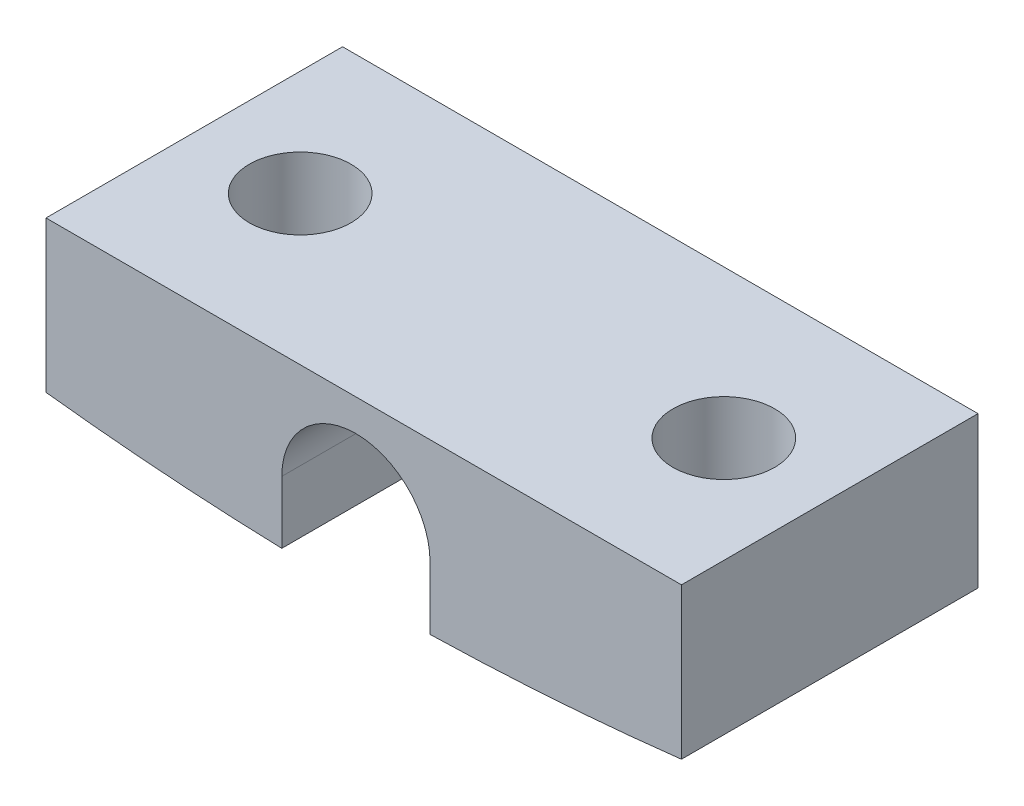
ISO-10303-21;
HEADER;
FILE_DESCRIPTION(('STEP AP214'),'2;1');
FILE_NAME('part.step','',(''),(''),'','','');
FILE_SCHEMA(('AUTOMOTIVE_DESIGN { 1 0 10303 214 1 1 1 1 }'));
ENDSEC;
DATA;
#1=APPLICATION_CONTEXT('core data for automotive mechanical design processes');
#2=APPLICATION_PROTOCOL_DEFINITION('international standard','automotive_design',2000,#1);
#3=PRODUCT_CONTEXT('',#1,'mechanical');
#4=PRODUCT('Part','Part','',(#3));
#5=PRODUCT_RELATED_PRODUCT_CATEGORY('part','',(#4));
#6=PRODUCT_DEFINITION_FORMATION('','',#4);
#7=PRODUCT_DEFINITION_CONTEXT('part definition',#1,'design');
#8=PRODUCT_DEFINITION('design','',#6,#7);
#9=PRODUCT_DEFINITION_SHAPE('','',#8);
#10=(LENGTH_UNIT() NAMED_UNIT(*) SI_UNIT(.MILLI.,.METRE.));
#11=(NAMED_UNIT(*) PLANE_ANGLE_UNIT() SI_UNIT($,.RADIAN.));
#12=(NAMED_UNIT(*) SI_UNIT($,.STERADIAN.) SOLID_ANGLE_UNIT());
#13=UNCERTAINTY_MEASURE_WITH_UNIT(LENGTH_MEASURE(1.E-05),#10,'distance_accuracy_value','');
#14=(GEOMETRIC_REPRESENTATION_CONTEXT(3) GLOBAL_UNCERTAINTY_ASSIGNED_CONTEXT((#13)) GLOBAL_UNIT_ASSIGNED_CONTEXT((#10,
#11,#12)) REPRESENTATION_CONTEXT('',''));
#15=CARTESIAN_POINT('',(0.,0.,0.));
#16=DIRECTION('',(0.,0.,1.));
#17=DIRECTION('',(1.,0.,0.));
#18=AXIS2_PLACEMENT_3D('',#15,#16,#17);
#19=CARTESIAN_POINT('',(0.,0.,7.));
#20=DIRECTION('',(1.,0.,0.));
#21=DIRECTION('',(0.,0.,-1.));
#22=AXIS2_PLACEMENT_3D('',#19,#20,#21);
#23=PLANE('',#22);
#24=DIRECTION('',(0.,-1.,0.));
#25=VECTOR('',#24,1.);
#26=CARTESIAN_POINT('',(0.,0.,0.));
#27=LINE('',#26,#25);
#28=CARTESIAN_POINT('',(0.,0.,0.));
#29=VERTEX_POINT('',#28);
#30=CARTESIAN_POINT('',(0.,-3.56585785072482,0.));
#31=VERTEX_POINT('',#30);
#32=EDGE_CURVE('E140',#29,#31,#27,.T.);
#33=ORIENTED_EDGE('',*,*,#32,.T.);
#34=DIRECTION('',(0.,0.,-1.));
#35=VECTOR('',#34,1.);
#36=CARTESIAN_POINT('',(0.,-3.56585785072482,7.));
#37=LINE('',#36,#35);
#38=CARTESIAN_POINT('',(0.,-3.56585785072482,7.));
#39=VERTEX_POINT('',#38);
#40=EDGE_CURVE('E11',#39,#31,#37,.T.);
#41=ORIENTED_EDGE('',*,*,#40,.F.);
#42=DIRECTION('',(0.,-1.,0.));
#43=VECTOR('',#42,1.);
#44=CARTESIAN_POINT('',(0.,0.,7.));
#45=LINE('',#44,#43);
#46=CARTESIAN_POINT('',(0.,0.,7.));
#47=VERTEX_POINT('',#46);
#48=EDGE_CURVE('E163',#47,#39,#45,.T.);
#49=ORIENTED_EDGE('',*,*,#48,.F.);
#50=DIRECTION('',(0.,0.,-1.));
#51=VECTOR('',#50,1.);
#52=CARTESIAN_POINT('',(0.,0.,7.));
#53=LINE('',#52,#51);
#54=EDGE_CURVE('E136',#47,#29,#53,.T.);
#55=ORIENTED_EDGE('',*,*,#54,.T.);
#56=EDGE_LOOP('',(#33,#41,#49,#55));
#57=FACE_BOUND('',#56,.T.);
#58=ADVANCED_FACE('F39',(#57),#23,.F.);
#59=CARTESIAN_POINT('',(7.5,61.,7.));
#60=DIRECTION('',(0.,0.,-1.));
#61=DIRECTION('',(-1.,0.,0.));
#62=AXIS2_PLACEMENT_3D('',#59,#60,#61);
#63=CYLINDRICAL_SURFACE('',#62,65.);
#64=CARTESIAN_POINT('',(2.5,-3.80740698407863,4.7));
#65=CARTESIAN_POINT('',(2.56748697636121,-3.81261356681244,4.6999970427773));
#66=CARTESIAN_POINT('',(2.63503052118988,-3.81771763752998,4.69428811494105));
#67=CARTESIAN_POINT('',(2.76827643873237,-3.82758109221733,4.67158244655303));
#68=CARTESIAN_POINT('',(2.83397653683242,-3.83234006092647,4.65457234934861));
#69=CARTESIAN_POINT('',(2.9615878821308,-3.8413980884566,4.60973267814247));
#70=CARTESIAN_POINT('',(3.02350055597054,-3.84569732091256,4.58190720746752));
#71=CARTESIAN_POINT('',(3.1417695586381,-3.8537535177467,4.51622185433156));
#72=CARTESIAN_POINT('',(3.19812727952696,-3.85751061809225,4.47836449465973));
#73=CARTESIAN_POINT('',(3.30360157895749,-3.86442040205466,4.39374940368321));
#74=CARTESIAN_POINT('',(3.35272977582148,-3.86757405795157,4.34700623581467));
#75=CARTESIAN_POINT('',(3.4424436189067,-3.87324766128861,4.24590069268484));
#76=CARTESIAN_POINT('',(3.48302902745785,-3.87576759109814,4.19153810551271));
#77=CARTESIAN_POINT('',(3.55440682594677,-3.88014777384982,4.07686844025071));
#78=CARTESIAN_POINT('',(3.58522067086728,-3.88200947308768,4.01657477183992));
#79=CARTESIAN_POINT('',(3.63629182508447,-3.88507083680707,3.89165550200719));
#80=CARTESIAN_POINT('',(3.65654924633519,-3.88627050830961,3.82702994653443));
#81=CARTESIAN_POINT('',(3.68590409538918,-3.88800267081557,3.69538019009488));
#82=CARTESIAN_POINT('',(3.69501734001273,-3.88853610742265,3.62835952795235));
#83=CARTESIAN_POINT('',(3.70187488953552,-3.88893787106932,3.49373731857466));
#84=CARTESIAN_POINT('',(3.69961926395501,-3.88880620217601,3.42613577489409));
#85=CARTESIAN_POINT('',(3.68380843977458,-3.88787824636898,3.29231070889273));
#86=CARTESIAN_POINT('',(3.67025959346128,-3.88708233308359,3.22608643333561));
#87=CARTESIAN_POINT('',(3.63225913366047,-3.88482827187019,3.09685558446968));
#88=CARTESIAN_POINT('',(3.60780751632842,-3.88337012370866,3.03384901229552));
#89=CARTESIAN_POINT('',(3.54869456545837,-3.87979699394782,2.91282351178039));
#90=CARTESIAN_POINT('',(3.51403066941009,-3.87768184748434,2.8548058400025));
#91=CARTESIAN_POINT('',(3.43548767936644,-3.87280849913409,2.74541624626118));
#92=CARTESIAN_POINT('',(3.3916085561381,-3.87005029520738,2.69404434538063));
#93=CARTESIAN_POINT('',(3.29583575900342,-3.86391371567439,2.59934155393566));
#94=CARTESIAN_POINT('',(3.24393338906796,-3.86053466640393,2.55601950177303));
#95=CARTESIAN_POINT('',(3.13362978713657,-3.8532023980329,2.47870196947646));
#96=CARTESIAN_POINT('',(3.07522849633024,-3.84924917373637,2.44470657375146));
#97=CARTESIAN_POINT('',(2.95346881266143,-3.84082649908973,2.38693417020478));
#98=CARTESIAN_POINT('',(2.89010105344697,-3.83635606538225,2.36317704699616));
#99=CARTESIAN_POINT('',(2.76030682904079,-3.826996996447,2.32663473850638));
#100=CARTESIAN_POINT('',(2.69388032209297,-3.82210835550935,2.31384970305612));
#101=CARTESIAN_POINT('',(2.55968479963298,-3.81201912326577,2.29958272925982));
#102=CARTESIAN_POINT('',(2.49191293565621,-3.80681780888299,2.29812809263768));
#103=CARTESIAN_POINT('',(2.35710026078259,-3.79625880164344,2.30662599406766));
#104=CARTESIAN_POINT('',(2.29005945977087,-3.79090110667576,2.31657868617245));
#105=CARTESIAN_POINT('',(2.158479486999,-3.78018621478547,2.34763649446902));
#106=CARTESIAN_POINT('',(2.0939452097668,-3.77482903739578,2.3687623583736));
#107=CARTESIAN_POINT('',(1.96934061158705,-3.76430899808609,2.42158460381176));
#108=CARTESIAN_POINT('',(1.90927030888214,-3.75914613696025,2.45328102854044));
#109=CARTESIAN_POINT('',(1.79530553586515,-3.74920646298771,2.52635359410712));
#110=CARTESIAN_POINT('',(1.74141075492827,-3.74442963072758,2.56772924776741));
#111=CARTESIAN_POINT('',(1.64133700302038,-3.73545085403167,2.65899830120204));
#112=CARTESIAN_POINT('',(1.59515794419328,-3.73124890305004,2.70889160397597));
#113=CARTESIAN_POINT('',(1.51195805853995,-3.72360542930349,2.81564568752539));
#114=CARTESIAN_POINT('',(1.47491360378869,-3.72016194717247,2.87248791127337));
#115=CARTESIAN_POINT('',(1.41090194997004,-3.71417096032129,2.99163175731559));
#116=CARTESIAN_POINT('',(1.38393450038622,-3.7116234333276,3.0539332438439));
#117=CARTESIAN_POINT('',(1.34095433448316,-3.70754688492284,3.18195337298819));
#118=CARTESIAN_POINT('',(1.32489715588899,-3.70601373035207,3.24765695754023));
#119=CARTESIAN_POINT('',(1.30402986477841,-3.70401893075088,3.38084213171038));
#120=CARTESIAN_POINT('',(1.29921953656517,-3.703557265171,3.4483236872047));
#121=CARTESIAN_POINT('',(1.30098391653205,-3.70372632272258,3.58292652992813));
#122=CARTESIAN_POINT('',(1.30752343108642,-3.70435366904387,3.65004828576474));
#123=CARTESIAN_POINT('',(1.33172863707968,-3.70666560896061,3.78223542008374));
#124=CARTESIAN_POINT('',(1.3493943079441,-3.708350200601,3.84730080236855));
#125=CARTESIAN_POINT('',(1.39533904479301,-3.71270078958495,3.97353556972549));
#126=CARTESIAN_POINT('',(1.42361838956636,-3.71536681270768,4.0347048524096));
#127=CARTESIAN_POINT('',(1.48997386416598,-3.72156280090309,4.15142444758804));
#128=CARTESIAN_POINT('',(1.52804975480424,-3.72509274488256,4.20697489722311));
#129=CARTESIAN_POINT('',(1.61303804873376,-3.73287804680886,4.31106511780965));
#130=CARTESIAN_POINT('',(1.65997650839443,-3.73713554018909,4.35958345101748));
#131=CARTESIAN_POINT('',(1.76129486133141,-3.74619560055533,4.4480713589515));
#132=CARTESIAN_POINT('',(1.81567675390955,-3.7509983139278,4.4880386294493));
#133=CARTESIAN_POINT('',(1.93059202288765,-3.76098388696536,4.5584603642937));
#134=CARTESIAN_POINT('',(1.99115233890076,-3.76616838139999,4.58887058487424));
#135=CARTESIAN_POINT('',(2.11645943864973,-3.77670436291486,4.63905295011898));
#136=CARTESIAN_POINT('',(2.18120122000406,-3.78205564663453,4.65883755173386));
#137=CARTESIAN_POINT('',(2.28862095912954,-3.79076534882443,4.68200158806683));
#138=CARTESIAN_POINT('',(2.33060355573306,-3.79412885436817,4.68874213696771));
#139=CARTESIAN_POINT('',(2.41504996093094,-3.80081077754717,4.69774227873978));
#140=CARTESIAN_POINT('',(2.45751377058826,-3.80412919508279,4.70000186171093));
#141=CARTESIAN_POINT('',(2.5,-3.80740698407863,4.7));
#142=B_SPLINE_CURVE_WITH_KNOTS('',3,(#64,#65,#66,#67,#68,#69,#70,#71,#72,#73,#74,#75,#76,#77,
#78,#79,#80,#81,#82,#83,#84,#85,#86,#87,#88,#89,#90,#91,#92,#93,#94,#95,#96,#97,#98,#99,#100,
#101,#102,#103,#104,#105,#106,#107,#108,#109,#110,#111,#112,#113,#114,#115,#116,#117,#118,#119,
#120,#121,#122,#123,#124,#125,#126,#127,#128,#129,#130,#131,#132,#133,#134,#135,#136,#137,#138,
#139,#140,#141),.UNSPECIFIED.,.T.,.F.,(4,2,2,2,2,2,2,2,2,2,2,2,2,2,2,2,2,2,2,2,2,2,2,2,2,2,2,2,
2,2,2,2,2,2,2,2,2,2,4),(0.,0.202907483877588,0.406055208155391,0.609125933787615,
0.812145640190123,1.014835431354,1.21753086083294,1.41977810918528,1.62202321260087,
1.82398093712403,2.0259374266841,2.22778039500154,2.42962343449313,2.63151716453593,
2.83341153504512,3.03552628405519,3.23764286220216,3.44015023804332,3.6426603792085,
3.84565833821928,4.04865903869106,4.25203802608378,4.4554178445661,4.65878742867887,
4.86215469693931,5.06499027540032,5.26782081099149,5.46981971887391,5.67181475270435,
5.87318455824773,6.07455399141938,6.2759287143225,6.47729852101858,6.67926985267407,
6.8812955405634,7.08424316726983,7.28695234594539,7.41469187922927,7.54243169473442),.UNSPECIFIED.);
#143=CARTESIAN_POINT('',(2.5,-3.80740698407863,4.7));
#144=VERTEX_POINT('',#143);
#145=EDGE_CURVE('E215',#144,#144,#142,.T.);
#146=ORIENTED_EDGE('',*,*,#145,.T.);
#147=EDGE_LOOP('',(#146));
#148=FACE_BOUND('',#147,.T.);
#149=CARTESIAN_POINT('',(7.5,61.,0.));
#150=DIRECTION('',(0.,0.,1.));
#151=DIRECTION('',(-1.,0.,0.));
#152=AXIS2_PLACEMENT_3D('',#149,#150,#151);
#153=CIRCLE('',#152,65.);
#154=CARTESIAN_POINT('',(5.56592405859445,-3.97121939946085,0.));
#155=VERTEX_POINT('',#154);
#156=EDGE_CURVE('E144',#31,#155,#153,.T.);
#157=ORIENTED_EDGE('',*,*,#156,.T.);
#158=DIRECTION('',(0.,0.,-1.));
#159=VECTOR('',#158,1.);
#160=CARTESIAN_POINT('',(5.56592405859445,-3.97121939946085,7.));
#161=LINE('',#160,#159);
#162=CARTESIAN_POINT('',(5.56592405859445,-3.97121939946085,7.));
#163=VERTEX_POINT('',#162);
#164=EDGE_CURVE('E48',#163,#155,#161,.T.);
#165=ORIENTED_EDGE('',*,*,#164,.F.);
#166=CARTESIAN_POINT('',(7.5,61.,7.));
#167=DIRECTION('',(0.,0.,1.));
#168=DIRECTION('',(-1.,0.,0.));
#169=AXIS2_PLACEMENT_3D('',#166,#167,#168);
#170=CIRCLE('',#169,65.);
#171=EDGE_CURVE('E99',#39,#163,#170,.T.);
#172=ORIENTED_EDGE('',*,*,#171,.F.);
#173=ORIENTED_EDGE('',*,*,#40,.T.);
#174=EDGE_LOOP('',(#157,#165,#172,#173));
#175=FACE_BOUND('',#174,.T.);
#176=ADVANCED_FACE('F246',(#148,#175),#63,.T.);
#177=CARTESIAN_POINT('',(5.56592405859445,-2.5,7.));
#178=DIRECTION('',(-1.,0.,0.));
#179=DIRECTION('',(0.,0.,1.));
#180=AXIS2_PLACEMENT_3D('',#177,#178,#179);
#181=PLANE('',#180);
#182=DIRECTION('',(0.,1.,0.));
#183=VECTOR('',#182,1.);
#184=CARTESIAN_POINT('',(5.56592405859445,-2.5,0.));
#185=LINE('',#184,#183);
#186=CARTESIAN_POINT('',(5.56592405859445,-2.5,0.));
#187=VERTEX_POINT('',#186);
#188=EDGE_CURVE('E148',#155,#187,#185,.T.);
#189=ORIENTED_EDGE('',*,*,#188,.T.);
#190=DIRECTION('',(0.,0.,-1.));
#191=VECTOR('',#190,1.);
#192=CARTESIAN_POINT('',(5.56592405859445,-2.5,7.));
#193=LINE('',#192,#191);
#194=CARTESIAN_POINT('',(5.56592405859445,-2.5,7.));
#195=VERTEX_POINT('',#194);
#196=EDGE_CURVE('E174',#195,#187,#193,.T.);
#197=ORIENTED_EDGE('',*,*,#196,.F.);
#198=DIRECTION('',(0.,1.,0.));
#199=VECTOR('',#198,1.);
#200=CARTESIAN_POINT('',(5.56592405859445,-2.5,7.));
#201=LINE('',#200,#199);
#202=EDGE_CURVE('E184',#163,#195,#201,.T.);
#203=ORIENTED_EDGE('',*,*,#202,.F.);
#204=ORIENTED_EDGE('',*,*,#164,.T.);
#205=EDGE_LOOP('',(#189,#197,#203,#204));
#206=FACE_BOUND('',#205,.T.);
#207=ADVANCED_FACE('F182',(#206),#181,.F.);
#208=CARTESIAN_POINT('',(7.31592405859445,-2.5,7.));
#209=DIRECTION('',(0.,0.,-1.));
#210=DIRECTION('',(-1.,0.,0.));
#211=AXIS2_PLACEMENT_3D('',#208,#209,#210);
#212=CYLINDRICAL_SURFACE('',#211,1.75);
#213=CARTESIAN_POINT('',(7.31592405859445,-2.5,0.));
#214=DIRECTION('',(0.,0.,-1.));
#215=DIRECTION('',(1.,0.,0.));
#216=AXIS2_PLACEMENT_3D('',#213,#214,#215);
#217=CIRCLE('',#216,1.75);
#218=CARTESIAN_POINT('',(9.06592405859445,-2.5,0.));
#219=VERTEX_POINT('',#218);
#220=EDGE_CURVE('E151',#187,#219,#217,.T.);
#221=ORIENTED_EDGE('',*,*,#220,.T.);
#222=DIRECTION('',(0.,0.,-1.));
#223=VECTOR('',#222,1.);
#224=CARTESIAN_POINT('',(9.06592405859445,-2.5,7.));
#225=LINE('',#224,#223);
#226=CARTESIAN_POINT('',(9.06592405859445,-2.5,7.));
#227=VERTEX_POINT('',#226);
#228=EDGE_CURVE('E170',#227,#219,#225,.T.);
#229=ORIENTED_EDGE('',*,*,#228,.F.);
#230=CARTESIAN_POINT('',(7.31592405859445,-2.5,7.));
#231=DIRECTION('',(0.,0.,-1.));
#232=DIRECTION('',(1.,0.,0.));
#233=AXIS2_PLACEMENT_3D('',#230,#231,#232);
#234=CIRCLE('',#233,1.75);
#235=EDGE_CURVE('E197',#195,#227,#234,.T.);
#236=ORIENTED_EDGE('',*,*,#235,.F.);
#237=ORIENTED_EDGE('',*,*,#196,.T.);
#238=EDGE_LOOP('',(#221,#229,#236,#237));
#239=FACE_BOUND('',#238,.T.);
#240=ADVANCED_FACE('F192',(#239),#212,.F.);
#241=CARTESIAN_POINT('',(9.06592405859445,-2.5,7.));
#242=DIRECTION('',(1.,0.,0.));
#243=DIRECTION('',(0.,0.,-1.));
#244=AXIS2_PLACEMENT_3D('',#241,#242,#243);
#245=PLANE('',#244);
#246=DIRECTION('',(0.,-1.,0.));
#247=VECTOR('',#246,1.);
#248=CARTESIAN_POINT('',(9.06592405859445,-2.5,0.));
#249=LINE('',#248,#247);
#250=CARTESIAN_POINT('',(9.06592405859449,-3.98113481498086,0.));
#251=VERTEX_POINT('',#250);
#252=EDGE_CURVE('E154',#219,#251,#249,.T.);
#253=ORIENTED_EDGE('',*,*,#252,.T.);
#254=DIRECTION('',(0.,0.,-1.));
#255=VECTOR('',#254,1.);
#256=CARTESIAN_POINT('',(9.06592405859449,-3.98113481498086,7.));
#257=LINE('',#256,#255);
#258=CARTESIAN_POINT('',(9.06592405859449,-3.98113481498086,7.));
#259=VERTEX_POINT('',#258);
#260=EDGE_CURVE('E129',#259,#251,#257,.T.);
#261=ORIENTED_EDGE('',*,*,#260,.F.);
#262=DIRECTION('',(0.,-1.,0.));
#263=VECTOR('',#262,1.);
#264=CARTESIAN_POINT('',(9.06592405859445,-2.5,7.));
#265=LINE('',#264,#263);
#266=EDGE_CURVE('E118',#227,#259,#265,.T.);
#267=ORIENTED_EDGE('',*,*,#266,.F.);
#268=ORIENTED_EDGE('',*,*,#228,.T.);
#269=EDGE_LOOP('',(#253,#261,#267,#268));
#270=FACE_BOUND('',#269,.T.);
#271=ADVANCED_FACE('F195',(#270),#245,.F.);
#272=CARTESIAN_POINT('',(7.5,61.,7.));
#273=DIRECTION('',(0.,0.,-1.));
#274=DIRECTION('',(-1.,0.,0.));
#275=AXIS2_PLACEMENT_3D('',#272,#273,#274);
#276=CYLINDRICAL_SURFACE('',#275,65.);
#277=CARTESIAN_POINT('',(12.5,-3.80740698407863,4.7));
#278=CARTESIAN_POINT('',(12.5676079328118,-3.80219076641432,4.69999701874339));
#279=CARTESIAN_POINT('',(12.6352568007582,-3.79686412858168,4.69426752265331));
#280=CARTESIAN_POINT('',(12.7686768866028,-3.78615236610259,4.67149611624057));
#281=CARTESIAN_POINT('',(12.8344457178646,-3.78076717813699,4.65444043976958));
#282=CARTESIAN_POINT('',(12.9621571064216,-3.77012385490482,4.60949947622277));
#283=CARTESIAN_POINT('',(13.024101405237,-3.76486566248427,4.58161916098744));
#284=CARTESIAN_POINT('',(13.1424126661151,-3.75466554224104,4.51581854280325));
#285=CARTESIAN_POINT('',(13.1987810394091,-3.74972353450646,4.47790078924283));
#286=CARTESIAN_POINT('',(13.304318963713,-3.74034824828701,4.39311240756938));
#287=CARTESIAN_POINT('',(13.353492867634,-3.7359146625427,4.34624723286361));
#288=CARTESIAN_POINT('',(13.44326960102,-3.7277342712962,4.24486704060441));
#289=CARTESIAN_POINT('',(13.4838722246343,-3.72398748228863,4.19035183937781));
#290=CARTESIAN_POINT('',(13.5552075450231,-3.71735273898926,4.07541028006625));
#291=CARTESIAN_POINT('',(13.5859724473878,-3.71446198465709,4.01500407275895));
#292=CARTESIAN_POINT('',(13.6369188284019,-3.7096506407178,3.88984639888497));
#293=CARTESIAN_POINT('',(13.6571005928102,-3.70773002491573,3.82509504969613));
#294=CARTESIAN_POINT('',(13.6862294778066,-3.70495174450411,3.69336830960287));
#295=CARTESIAN_POINT('',(13.6952220439758,-3.70408978030516,3.62640305679031));
#296=CARTESIAN_POINT('',(13.7018600363087,-3.7034538788749,3.49190797560133));
#297=CARTESIAN_POINT('',(13.6995056718329,-3.70367992156893,3.42437815766457));
#298=CARTESIAN_POINT('',(13.6835374807376,-3.70520788096447,3.29083182215485));
#299=CARTESIAN_POINT('',(13.6699491652472,-3.70650735999867,3.22481222378874));
#300=CARTESIAN_POINT('',(13.631941589594,-3.71012018013844,3.09599785227437));
#301=CARTESIAN_POINT('',(13.607522291615,-3.71243352478391,3.03320309038645));
#302=CARTESIAN_POINT('',(13.5485259819889,-3.71797437985506,2.91254084610492));
#303=CARTESIAN_POINT('',(13.5139378360499,-3.72120289219612,2.85467885486479));
#304=CARTESIAN_POINT('',(13.4356067315418,-3.72843358713651,2.74557974795413));
#305=CARTESIAN_POINT('',(13.3918636045821,-3.73243578396639,2.69434275416751));
#306=CARTESIAN_POINT('',(13.2962892196844,-3.74106375762784,2.59974397057476));
#307=CARTESIAN_POINT('',(13.244428712271,-3.74569178096634,2.55641193779483));
#308=CARTESIAN_POINT('',(13.1342084572375,-3.75537623071669,2.47906278752398));
#309=CARTESIAN_POINT('',(13.0758485643809,-3.76043266670134,2.44504587824936));
#310=CARTESIAN_POINT('',(12.9540388561216,-3.77080520089573,2.38715985861868));
#311=CARTESIAN_POINT('',(12.8905702845253,-3.77612222504657,2.36333037765972));
#312=CARTESIAN_POINT('',(12.7605350679582,-3.78681211487458,2.32667788643062));
#313=CARTESIAN_POINT('',(12.6939683838823,-3.79218498125592,2.31385501512853));
#314=CARTESIAN_POINT('',(12.5594920407329,-3.80282475805227,2.29956629804161));
#315=CARTESIAN_POINT('',(12.4915801162494,-3.80809145305749,2.29812159747693));
#316=CARTESIAN_POINT('',(12.3564626464346,-3.81835667287239,2.30669385889649));
#317=CARTESIAN_POINT('',(12.2892571002613,-3.82335519800175,2.31671080721711));
#318=CARTESIAN_POINT('',(12.1575103410342,-3.83295427017921,2.34792332466148));
#319=CARTESIAN_POINT('',(12.0929674207425,-3.83755507438085,2.36911160687722));
#320=CARTESIAN_POINT('',(11.9683449976557,-3.84626279530248,2.42207295851766));
#321=CARTESIAN_POINT('',(11.9082654474563,-3.85036971726818,2.45384591550505));
#322=CARTESIAN_POINT('',(11.7944189073427,-3.85800813479474,2.527002743425));
#323=CARTESIAN_POINT('',(11.7406384909073,-3.86154086072139,2.568365591058));
#324=CARTESIAN_POINT('',(11.64078370737,-3.86799225312819,2.659571797245));
#325=CARTESIAN_POINT('',(11.5947092479506,-3.8709109269648,2.70941505418927));
#326=CARTESIAN_POINT('',(11.511690944231,-3.8760978089135,2.81604101886321));
#327=CARTESIAN_POINT('',(11.4747259769057,-3.87836752382471,2.87280720757524));
#328=CARTESIAN_POINT('',(11.4108494038633,-3.88224938639056,2.99175960214329));
#329=CARTESIAN_POINT('',(11.3839376910914,-3.88386154104744,3.05394575027467));
#330=CARTESIAN_POINT('',(11.3409784977962,-3.88641883880214,3.18185946751803));
#331=CARTESIAN_POINT('',(11.3249127487952,-3.88736510361087,3.24758087931595));
#332=CARTESIAN_POINT('',(11.3040338087334,-3.88859250961386,3.38079353902299));
#333=CARTESIAN_POINT('',(11.2992205744145,-3.88887365336504,3.44828478012735));
#334=CARTESIAN_POINT('',(11.3009841429905,-3.88877036999467,3.58306174535417));
#335=CARTESIAN_POINT('',(11.3075515409828,-3.88838649244377,3.65034759318613));
#336=CARTESIAN_POINT('',(11.3318698334919,-3.88695492906512,3.78285969289429));
#337=CARTESIAN_POINT('',(11.349620731083,-3.88590724305491,3.84808594420432));
#338=CARTESIAN_POINT('',(11.3957975101795,-3.88315107312381,3.97462973765123));
#339=CARTESIAN_POINT('',(11.4242235955108,-3.88144257658576,4.03594720512984));
#340=CARTESIAN_POINT('',(11.4909353378464,-3.87737315116303,4.15293366646705));
#341=CARTESIAN_POINT('',(11.5292206285187,-3.8750122465192,4.20860287008726));
#342=CARTESIAN_POINT('',(11.6145869690868,-3.8696539167059,4.31276157276596));
#343=CARTESIAN_POINT('',(11.6616743336875,-3.86665603434926,4.36124587224474));
#344=CARTESIAN_POINT('',(11.7632969211131,-3.86005617001187,4.44963359689763));
#345=CARTESIAN_POINT('',(11.8178340369762,-3.8564540344326,4.48953483439386));
#346=CARTESIAN_POINT('',(11.9329103209651,-3.84869032456393,4.55969925927193));
#347=CARTESIAN_POINT('',(11.9934622061056,-3.84452755803,4.58994143034178));
#348=CARTESIAN_POINT('',(12.1187025019983,-3.83572712390326,4.63980037354292));
#349=CARTESIAN_POINT('',(12.1833859350812,-3.83109002387824,4.65942967176219));
#350=CARTESIAN_POINT('',(12.2903968840322,-3.823250572434,4.68230544212189));
#351=CARTESIAN_POINT('',(12.3320402398312,-3.82016005753021,4.68893326739226));
#352=CARTESIAN_POINT('',(12.4157837684092,-3.81386297309419,4.69778147659793));
#353=CARTESIAN_POINT('',(12.4578839415376,-3.81065640347315,4.70000185716043));
#354=CARTESIAN_POINT('',(12.5,-3.80740698407863,4.7));
#355=B_SPLINE_CURVE_WITH_KNOTS('',3,(#277,#278,#279,#280,#281,#282,#283,#284,#285,#286,#287,
#288,#289,#290,#291,#292,#293,#294,#295,#296,#297,#298,#299,#300,#301,#302,#303,#304,#305,#306,
#307,#308,#309,#310,#311,#312,#313,#314,#315,#316,#317,#318,#319,#320,#321,#322,#323,#324,#325,
#326,#327,#328,#329,#330,#331,#332,#333,#334,#335,#336,#337,#338,#339,#340,#341,#342,#343,#344,
#345,#346,#347,#348,#349,#350,#351,#352,#353,#354),.UNSPECIFIED.,.T.,.F.,(4,2,2,2,2,2,2,2,2,2,2,
2,2,2,2,2,2,2,2,2,2,2,2,2,2,2,2,2,2,2,2,2,2,2,2,2,2,2,4),(0.,0.203272410835669,
0.406792337799494,0.610218896858625,0.813593837513647,1.01684521563889,1.2201014745596,
1.42268535794106,1.62526377100768,1.82701668548953,2.02876587747247,2.23005817253742,
2.43135117041832,2.63286539843389,2.83438333329638,3.03664486629862,3.2389109199831,
3.44195678908584,3.645005221782,3.84843091134608,4.05185635840304,4.25514927769203,
4.45844003754022,4.66128928107707,4.86413609430597,5.06650802594263,5.26887780250417,
5.47090585989486,5.67293314062803,5.8747935465473,6.07665400795608,6.27851832377101,
6.48037514013155,6.68237733047752,6.88443094693016,7.08692124552979,7.28917202564618,
7.41579956521375,7.54242720168304),.UNSPECIFIED.);
#356=CARTESIAN_POINT('',(12.5,-3.80740698407863,4.7));
#357=VERTEX_POINT('',#356);
#358=EDGE_CURVE('E145',#357,#357,#355,.T.);
#359=ORIENTED_EDGE('',*,*,#358,.T.);
#360=EDGE_LOOP('',(#359));
#361=FACE_BOUND('',#360,.T.);
#362=CARTESIAN_POINT('',(7.5,61.,0.));
#363=DIRECTION('',(0.,0.,1.));
#364=DIRECTION('',(-1.,0.,0.));
#365=AXIS2_PLACEMENT_3D('',#362,#363,#364);
#366=CIRCLE('',#365,65.);
#367=CARTESIAN_POINT('',(15.,-3.5658578507248,0.));
#368=VERTEX_POINT('',#367);
#369=EDGE_CURVE('E127',#251,#368,#366,.T.);
#370=ORIENTED_EDGE('',*,*,#369,.T.);
#371=DIRECTION('',(0.,0.,-1.));
#372=VECTOR('',#371,1.);
#373=CARTESIAN_POINT('',(15.,-3.5658578507248,7.));
#374=LINE('',#373,#372);
#375=CARTESIAN_POINT('',(15.,-3.5658578507248,7.));
#376=VERTEX_POINT('',#375);
#377=EDGE_CURVE('E124',#376,#368,#374,.T.);
#378=ORIENTED_EDGE('',*,*,#377,.F.);
#379=CARTESIAN_POINT('',(7.5,61.,7.));
#380=DIRECTION('',(0.,0.,1.));
#381=DIRECTION('',(-1.,0.,0.));
#382=AXIS2_PLACEMENT_3D('',#379,#380,#381);
#383=CIRCLE('',#382,65.);
#384=EDGE_CURVE('E112',#259,#376,#383,.T.);
#385=ORIENTED_EDGE('',*,*,#384,.F.);
#386=ORIENTED_EDGE('',*,*,#260,.T.);
#387=EDGE_LOOP('',(#370,#378,#385,#386));
#388=FACE_BOUND('',#387,.T.);
#389=ADVANCED_FACE('F125',(#361,#388),#276,.T.);
#390=CARTESIAN_POINT('',(15.,0.,7.));
#391=DIRECTION('',(-1.,0.,0.));
#392=DIRECTION('',(0.,0.,1.));
#393=AXIS2_PLACEMENT_3D('',#390,#391,#392);
#394=PLANE('',#393);
#395=DIRECTION('',(0.,1.,0.));
#396=VECTOR('',#395,1.);
#397=CARTESIAN_POINT('',(15.,0.,0.));
#398=LINE('',#397,#396);
#399=CARTESIAN_POINT('',(15.,0.,0.));
#400=VERTEX_POINT('',#399);
#401=EDGE_CURVE('E85',#368,#400,#398,.T.);
#402=ORIENTED_EDGE('',*,*,#401,.T.);
#403=DIRECTION('',(0.,0.,-1.));
#404=VECTOR('',#403,1.);
#405=CARTESIAN_POINT('',(15.,0.,7.));
#406=LINE('',#405,#404);
#407=CARTESIAN_POINT('',(15.,0.,7.));
#408=VERTEX_POINT('',#407);
#409=EDGE_CURVE('E130',#408,#400,#406,.T.);
#410=ORIENTED_EDGE('',*,*,#409,.F.);
#411=DIRECTION('',(0.,1.,0.));
#412=VECTOR('',#411,1.);
#413=CARTESIAN_POINT('',(15.,0.,7.));
#414=LINE('',#413,#412);
#415=EDGE_CURVE('E116',#376,#408,#414,.T.);
#416=ORIENTED_EDGE('',*,*,#415,.F.);
#417=ORIENTED_EDGE('',*,*,#377,.T.);
#418=EDGE_LOOP('',(#402,#410,#416,#417));
#419=FACE_BOUND('',#418,.T.);
#420=ADVANCED_FACE('F132',(#419),#394,.F.);
#421=CARTESIAN_POINT('',(0.,0.,7.));
#422=DIRECTION('',(0.,-1.,0.));
#423=DIRECTION('',(0.,0.,-1.));
#424=AXIS2_PLACEMENT_3D('',#421,#422,#423);
#425=PLANE('',#424);
#426=CARTESIAN_POINT('',(12.5,0.,3.5));
#427=DIRECTION('',(0.,1.,0.));
#428=DIRECTION('',(0.,0.,1.));
#429=AXIS2_PLACEMENT_3D('',#426,#427,#428);
#430=CIRCLE('',#429,1.2);
#431=CARTESIAN_POINT('',(12.5,0.,4.7));
#432=VERTEX_POINT('',#431);
#433=EDGE_CURVE('E332',#432,#432,#430,.T.);
#434=ORIENTED_EDGE('',*,*,#433,.F.);
#435=EDGE_LOOP('',(#434));
#436=FACE_BOUND('',#435,.T.);
#437=CARTESIAN_POINT('',(2.5,0.,3.5));
#438=DIRECTION('',(0.,1.,0.));
#439=DIRECTION('',(0.,0.,1.));
#440=AXIS2_PLACEMENT_3D('',#437,#438,#439);
#441=CIRCLE('',#440,1.2);
#442=CARTESIAN_POINT('',(2.5,0.,4.7));
#443=VERTEX_POINT('',#442);
#444=EDGE_CURVE('E335',#443,#443,#441,.T.);
#445=ORIENTED_EDGE('',*,*,#444,.F.);
#446=EDGE_LOOP('',(#445));
#447=FACE_BOUND('',#446,.T.);
#448=DIRECTION('',(-1.,0.,0.));
#449=VECTOR('',#448,1.);
#450=CARTESIAN_POINT('',(0.,0.,0.));
#451=LINE('',#450,#449);
#452=EDGE_CURVE('E91',#400,#29,#451,.T.);
#453=ORIENTED_EDGE('',*,*,#452,.T.);
#454=ORIENTED_EDGE('',*,*,#54,.F.);
#455=DIRECTION('',(-1.,0.,0.));
#456=VECTOR('',#455,1.);
#457=CARTESIAN_POINT('',(0.,0.,7.));
#458=LINE('',#457,#456);
#459=EDGE_CURVE('E56',#408,#47,#458,.T.);
#460=ORIENTED_EDGE('',*,*,#459,.F.);
#461=ORIENTED_EDGE('',*,*,#409,.T.);
#462=EDGE_LOOP('',(#453,#454,#460,#461));
#463=FACE_BOUND('',#462,.T.);
#464=ADVANCED_FACE('F235',(#436,#447,#463),#425,.F.);
#465=CARTESIAN_POINT('',(7.5,61.,7.));
#466=DIRECTION('',(0.,0.,-1.));
#467=DIRECTION('',(-1.,0.,0.));
#468=AXIS2_PLACEMENT_3D('',#465,#466,#467);
#469=PLANE('',#468);
#470=ORIENTED_EDGE('',*,*,#48,.T.);
#471=ORIENTED_EDGE('',*,*,#171,.T.);
#472=ORIENTED_EDGE('',*,*,#202,.T.);
#473=ORIENTED_EDGE('',*,*,#235,.T.);
#474=ORIENTED_EDGE('',*,*,#266,.T.);
#475=ORIENTED_EDGE('',*,*,#384,.T.);
#476=ORIENTED_EDGE('',*,*,#415,.T.);
#477=ORIENTED_EDGE('',*,*,#459,.T.);
#478=EDGE_LOOP('',(#470,#471,#472,#473,#474,#475,#476,#477));
#479=FACE_BOUND('',#478,.T.);
#480=ADVANCED_FACE('F114',(#479),#469,.F.);
#481=CARTESIAN_POINT('',(7.5,61.,0.));
#482=DIRECTION('',(0.,0.,-1.));
#483=DIRECTION('',(-1.,0.,0.));
#484=AXIS2_PLACEMENT_3D('',#481,#482,#483);
#485=PLANE('',#484);
#486=ORIENTED_EDGE('',*,*,#32,.F.);
#487=ORIENTED_EDGE('',*,*,#452,.F.);
#488=ORIENTED_EDGE('',*,*,#401,.F.);
#489=ORIENTED_EDGE('',*,*,#369,.F.);
#490=ORIENTED_EDGE('',*,*,#252,.F.);
#491=ORIENTED_EDGE('',*,*,#220,.F.);
#492=ORIENTED_EDGE('',*,*,#188,.F.);
#493=ORIENTED_EDGE('',*,*,#156,.F.);
#494=EDGE_LOOP('',(#486,#487,#488,#489,#490,#491,#492,#493));
#495=FACE_BOUND('',#494,.T.);
#496=ADVANCED_FACE('F188',(#495),#485,.T.);
#497=CARTESIAN_POINT('',(2.5,-10.,3.5));
#498=DIRECTION('',(0.,1.,0.));
#499=DIRECTION('',(0.,0.,1.));
#500=AXIS2_PLACEMENT_3D('',#497,#498,#499);
#501=CYLINDRICAL_SURFACE('',#500,1.2);
#502=ORIENTED_EDGE('',*,*,#444,.T.);
#503=EDGE_LOOP('',(#502));
#504=FACE_BOUND('',#503,.T.);
#505=ORIENTED_EDGE('',*,*,#145,.F.);
#506=EDGE_LOOP('',(#505));
#507=FACE_BOUND('',#506,.T.);
#508=ADVANCED_FACE('F227',(#504,#507),#501,.F.);
#509=CARTESIAN_POINT('',(12.5,-10.,3.5));
#510=DIRECTION('',(0.,1.,0.));
#511=DIRECTION('',(0.,0.,1.));
#512=AXIS2_PLACEMENT_3D('',#509,#510,#511);
#513=CYLINDRICAL_SURFACE('',#512,1.2);
#514=ORIENTED_EDGE('',*,*,#433,.T.);
#515=EDGE_LOOP('',(#514));
#516=FACE_BOUND('',#515,.T.);
#517=ORIENTED_EDGE('',*,*,#358,.F.);
#518=EDGE_LOOP('',(#517));
#519=FACE_BOUND('',#518,.T.);
#520=ADVANCED_FACE('F224',(#516,#519),#513,.F.);
#521=CLOSED_SHELL('',(#58,#176,#207,#240,#271,#389,#420,#464,#480,#496,#508,#520));
#522=MANIFOLD_SOLID_BREP('B2',#521);
#523=ADVANCED_BREP_SHAPE_REPRESENTATION('',(#18,#522),#14);
#524=SHAPE_DEFINITION_REPRESENTATION(#9,#523);
ENDSEC;
END-ISO-10303-21;
